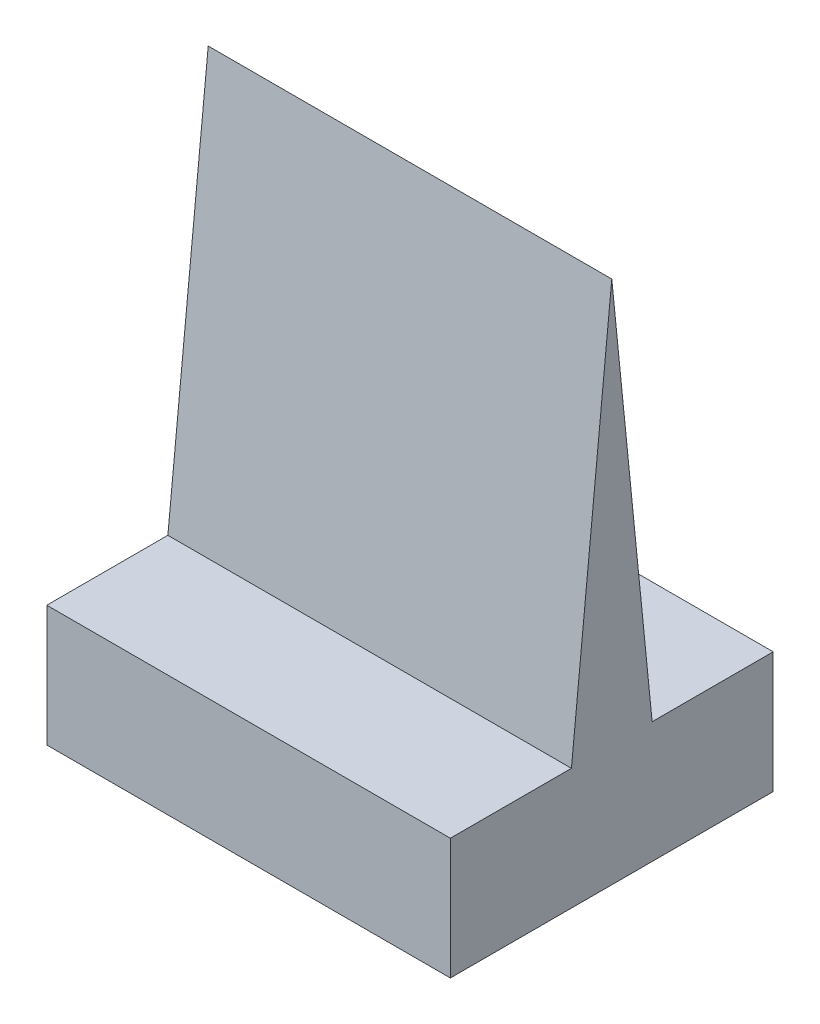
ISO-10303-21;
HEADER;
FILE_DESCRIPTION(('STEP AP214'),'2;1');
FILE_NAME('part.step','',(''),(''),'','','');
FILE_SCHEMA(('AUTOMOTIVE_DESIGN { 1 0 10303 214 1 1 1 1 }'));
ENDSEC;
DATA;
#1=APPLICATION_CONTEXT('core data for automotive mechanical design processes');
#2=APPLICATION_PROTOCOL_DEFINITION('international standard','automotive_design',2000,#1);
#3=PRODUCT_CONTEXT('',#1,'mechanical');
#4=PRODUCT('Part','Part','',(#3));
#5=PRODUCT_RELATED_PRODUCT_CATEGORY('part','',(#4));
#6=PRODUCT_DEFINITION_FORMATION('','',#4);
#7=PRODUCT_DEFINITION_CONTEXT('part definition',#1,'design');
#8=PRODUCT_DEFINITION('design','',#6,#7);
#9=PRODUCT_DEFINITION_SHAPE('','',#8);
#10=(LENGTH_UNIT() NAMED_UNIT(*) SI_UNIT(.MILLI.,.METRE.));
#11=(NAMED_UNIT(*) PLANE_ANGLE_UNIT() SI_UNIT($,.RADIAN.));
#12=(NAMED_UNIT(*) SI_UNIT($,.STERADIAN.) SOLID_ANGLE_UNIT());
#13=UNCERTAINTY_MEASURE_WITH_UNIT(LENGTH_MEASURE(1.E-05),#10,'distance_accuracy_value','');
#14=(GEOMETRIC_REPRESENTATION_CONTEXT(3) GLOBAL_UNCERTAINTY_ASSIGNED_CONTEXT((#13)) GLOBAL_UNIT_ASSIGNED_CONTEXT((#10,
#11,#12)) REPRESENTATION_CONTEXT('',''));
#15=CARTESIAN_POINT('',(0.,0.,0.));
#16=DIRECTION('',(0.,0.,1.));
#17=DIRECTION('',(1.,0.,0.));
#18=AXIS2_PLACEMENT_3D('',#15,#16,#17);
#19=CARTESIAN_POINT('',(12.7,16.51,0.));
#20=DIRECTION('',(0.,-0.0995037190209989,-0.995037190209989));
#21=DIRECTION('',(0.,0.995037190209989,-0.0995037190209989));
#22=AXIS2_PLACEMENT_3D('',#19,#20,#21);
#23=PLANE('',#22);
#24=DIRECTION('',(0.,-0.995037190209989,0.0995037190209989));
#25=VECTOR('',#24,1.);
#26=CARTESIAN_POINT('',(0.,16.51,0.));
#27=LINE('',#26,#25);
#28=CARTESIAN_POINT('',(0.,16.51,0.));
#29=VERTEX_POINT('',#28);
#30=CARTESIAN_POINT('',(0.,3.81,1.27));
#31=VERTEX_POINT('',#30);
#32=EDGE_CURVE('E123',#29,#31,#27,.T.);
#33=ORIENTED_EDGE('',*,*,#32,.T.);
#34=DIRECTION('',(-1.,0.,0.));
#35=VECTOR('',#34,1.);
#36=CARTESIAN_POINT('',(12.7,3.81,1.27));
#37=LINE('',#36,#35);
#38=CARTESIAN_POINT('',(12.7,3.81,1.27));
#39=VERTEX_POINT('',#38);
#40=EDGE_CURVE('E11',#39,#31,#37,.T.);
#41=ORIENTED_EDGE('',*,*,#40,.F.);
#42=DIRECTION('',(0.,-0.995037190209989,0.0995037190209989));
#43=VECTOR('',#42,1.);
#44=CARTESIAN_POINT('',(12.7,16.51,0.));
#45=LINE('',#44,#43);
#46=CARTESIAN_POINT('',(12.7,16.51,0.));
#47=VERTEX_POINT('',#46);
#48=EDGE_CURVE('E136',#47,#39,#45,.T.);
#49=ORIENTED_EDGE('',*,*,#48,.F.);
#50=DIRECTION('',(-1.,0.,0.));
#51=VECTOR('',#50,1.);
#52=CARTESIAN_POINT('',(12.7,16.51,0.));
#53=LINE('',#52,#51);
#54=EDGE_CURVE('E119',#47,#29,#53,.T.);
#55=ORIENTED_EDGE('',*,*,#54,.T.);
#56=EDGE_LOOP('',(#33,#41,#49,#55));
#57=FACE_BOUND('',#56,.T.);
#58=ADVANCED_FACE('F33',(#57),#23,.F.);
#59=CARTESIAN_POINT('',(12.7,3.81,1.27));
#60=DIRECTION('',(0.,-1.,0.));
#61=DIRECTION('',(0.,0.,-1.));
#62=AXIS2_PLACEMENT_3D('',#59,#60,#61);
#63=PLANE('',#62);
#64=DIRECTION('',(0.,0.,1.));
#65=VECTOR('',#64,1.);
#66=CARTESIAN_POINT('',(0.,3.81,1.27));
#67=LINE('',#66,#65);
#68=CARTESIAN_POINT('',(0.,3.81,5.08));
#69=VERTEX_POINT('',#68);
#70=EDGE_CURVE('E126',#31,#69,#67,.T.);
#71=ORIENTED_EDGE('',*,*,#70,.T.);
#72=DIRECTION('',(-1.,0.,0.));
#73=VECTOR('',#72,1.);
#74=CARTESIAN_POINT('',(12.7,3.81,5.08));
#75=LINE('',#74,#73);
#76=CARTESIAN_POINT('',(12.7,3.81,5.08));
#77=VERTEX_POINT('',#76);
#78=EDGE_CURVE('E41',#77,#69,#75,.T.);
#79=ORIENTED_EDGE('',*,*,#78,.F.);
#80=DIRECTION('',(0.,0.,1.));
#81=VECTOR('',#80,1.);
#82=CARTESIAN_POINT('',(12.7,3.81,1.27));
#83=LINE('',#82,#81);
#84=EDGE_CURVE('E89',#39,#77,#83,.T.);
#85=ORIENTED_EDGE('',*,*,#84,.F.);
#86=ORIENTED_EDGE('',*,*,#40,.T.);
#87=EDGE_LOOP('',(#71,#79,#85,#86));
#88=FACE_BOUND('',#87,.T.);
#89=ADVANCED_FACE('F180',(#88),#63,.F.);
#90=CARTESIAN_POINT('',(12.7,3.81,5.08));
#91=DIRECTION('',(0.,0.,-1.));
#92=DIRECTION('',(0.,1.,0.));
#93=AXIS2_PLACEMENT_3D('',#90,#91,#92);
#94=PLANE('',#93);
#95=DIRECTION('',(0.,-1.,0.));
#96=VECTOR('',#95,1.);
#97=CARTESIAN_POINT('',(0.,3.81,5.08));
#98=LINE('',#97,#96);
#99=CARTESIAN_POINT('',(0.,0.,5.08));
#100=VERTEX_POINT('',#99);
#101=EDGE_CURVE('E129',#69,#100,#98,.T.);
#102=ORIENTED_EDGE('',*,*,#101,.T.);
#103=DIRECTION('',(-1.,0.,0.));
#104=VECTOR('',#103,1.);
#105=CARTESIAN_POINT('',(12.7,0.,5.08));
#106=LINE('',#105,#104);
#107=CARTESIAN_POINT('',(12.7,0.,5.08));
#108=VERTEX_POINT('',#107);
#109=EDGE_CURVE('E140',#108,#100,#106,.T.);
#110=ORIENTED_EDGE('',*,*,#109,.F.);
#111=DIRECTION('',(0.,-1.,0.));
#112=VECTOR('',#111,1.);
#113=CARTESIAN_POINT('',(12.7,3.81,5.08));
#114=LINE('',#113,#112);
#115=EDGE_CURVE('E148',#77,#108,#114,.T.);
#116=ORIENTED_EDGE('',*,*,#115,.F.);
#117=ORIENTED_EDGE('',*,*,#78,.T.);
#118=EDGE_LOOP('',(#102,#110,#116,#117));
#119=FACE_BOUND('',#118,.T.);
#120=ADVANCED_FACE('F146',(#119),#94,.F.);
#121=CARTESIAN_POINT('',(12.7,0.,-5.08));
#122=DIRECTION('',(0.,1.,0.));
#123=DIRECTION('',(0.,0.,1.));
#124=AXIS2_PLACEMENT_3D('',#121,#122,#123);
#125=PLANE('',#124);
#126=CARTESIAN_POINT('',(6.35,0.,0.));
#127=DIRECTION('',(0.,-1.,0.));
#128=DIRECTION('',(0.,0.,-1.));
#129=AXIS2_PLACEMENT_3D('',#126,#127,#128);
#130=CIRCLE('',#129,2.54);
#131=CARTESIAN_POINT('',(6.35,0.,-2.54));
#132=VERTEX_POINT('',#131);
#133=EDGE_CURVE('E159',#132,#132,#130,.T.);
#134=ORIENTED_EDGE('',*,*,#133,.F.);
#135=EDGE_LOOP('',(#134));
#136=FACE_BOUND('',#135,.T.);
#137=DIRECTION('',(0.,0.,-1.));
#138=VECTOR('',#137,1.);
#139=CARTESIAN_POINT('',(0.,0.,-5.08));
#140=LINE('',#139,#138);
#141=CARTESIAN_POINT('',(0.,0.,-5.08));
#142=VERTEX_POINT('',#141);
#143=EDGE_CURVE('E131',#100,#142,#140,.T.);
#144=ORIENTED_EDGE('',*,*,#143,.T.);
#145=DIRECTION('',(-1.,0.,0.));
#146=VECTOR('',#145,1.);
#147=CARTESIAN_POINT('',(12.7,0.,-5.08));
#148=LINE('',#147,#146);
#149=CARTESIAN_POINT('',(12.7,0.,-5.08));
#150=VERTEX_POINT('',#149);
#151=EDGE_CURVE('E114',#150,#142,#148,.T.);
#152=ORIENTED_EDGE('',*,*,#151,.F.);
#153=DIRECTION('',(0.,0.,-1.));
#154=VECTOR('',#153,1.);
#155=CARTESIAN_POINT('',(12.7,0.,-5.08));
#156=LINE('',#155,#154);
#157=EDGE_CURVE('E105',#108,#150,#156,.T.);
#158=ORIENTED_EDGE('',*,*,#157,.F.);
#159=ORIENTED_EDGE('',*,*,#109,.T.);
#160=EDGE_LOOP('',(#144,#152,#158,#159));
#161=FACE_BOUND('',#160,.T.);
#162=ADVANCED_FACE('F154',(#136,#161),#125,.F.);
#163=CARTESIAN_POINT('',(12.7,3.81,-5.08));
#164=DIRECTION('',(0.,0.,1.));
#165=DIRECTION('',(0.,-1.,0.));
#166=AXIS2_PLACEMENT_3D('',#163,#164,#165);
#167=PLANE('',#166);
#168=DIRECTION('',(0.,1.,0.));
#169=VECTOR('',#168,1.);
#170=CARTESIAN_POINT('',(0.,3.81,-5.08));
#171=LINE('',#170,#169);
#172=CARTESIAN_POINT('',(0.,3.81,-5.08));
#173=VERTEX_POINT('',#172);
#174=EDGE_CURVE('E113',#142,#173,#171,.T.);
#175=ORIENTED_EDGE('',*,*,#174,.T.);
#176=DIRECTION('',(-1.,0.,0.));
#177=VECTOR('',#176,1.);
#178=CARTESIAN_POINT('',(12.7,3.81,-5.08));
#179=LINE('',#178,#177);
#180=CARTESIAN_POINT('',(12.7,3.81,-5.08));
#181=VERTEX_POINT('',#180);
#182=EDGE_CURVE('E110',#181,#173,#179,.T.);
#183=ORIENTED_EDGE('',*,*,#182,.F.);
#184=DIRECTION('',(0.,1.,0.));
#185=VECTOR('',#184,1.);
#186=CARTESIAN_POINT('',(12.7,3.81,-5.08));
#187=LINE('',#186,#185);
#188=EDGE_CURVE('E99',#150,#181,#187,.T.);
#189=ORIENTED_EDGE('',*,*,#188,.F.);
#190=ORIENTED_EDGE('',*,*,#151,.T.);
#191=EDGE_LOOP('',(#175,#183,#189,#190));
#192=FACE_BOUND('',#191,.T.);
#193=ADVANCED_FACE('F111',(#192),#167,.F.);
#194=CARTESIAN_POINT('',(12.7,3.81,-1.27));
#195=DIRECTION('',(0.,-1.,0.));
#196=DIRECTION('',(0.,0.,-1.));
#197=AXIS2_PLACEMENT_3D('',#194,#195,#196);
#198=PLANE('',#197);
#199=DIRECTION('',(0.,0.,1.));
#200=VECTOR('',#199,1.);
#201=CARTESIAN_POINT('',(0.,3.81,-1.27));
#202=LINE('',#201,#200);
#203=CARTESIAN_POINT('',(0.,3.81,-1.27));
#204=VERTEX_POINT('',#203);
#205=EDGE_CURVE('E75',#173,#204,#202,.T.);
#206=ORIENTED_EDGE('',*,*,#205,.T.);
#207=DIRECTION('',(-1.,0.,0.));
#208=VECTOR('',#207,1.);
#209=CARTESIAN_POINT('',(12.7,3.81,-1.27));
#210=LINE('',#209,#208);
#211=CARTESIAN_POINT('',(12.7,3.81,-1.27));
#212=VERTEX_POINT('',#211);
#213=EDGE_CURVE('E115',#212,#204,#210,.T.);
#214=ORIENTED_EDGE('',*,*,#213,.F.);
#215=DIRECTION('',(0.,0.,1.));
#216=VECTOR('',#215,1.);
#217=CARTESIAN_POINT('',(12.7,3.81,-1.27));
#218=LINE('',#217,#216);
#219=EDGE_CURVE('E103',#181,#212,#218,.T.);
#220=ORIENTED_EDGE('',*,*,#219,.F.);
#221=ORIENTED_EDGE('',*,*,#182,.T.);
#222=EDGE_LOOP('',(#206,#214,#220,#221));
#223=FACE_BOUND('',#222,.T.);
#224=ADVANCED_FACE('F117',(#223),#198,.F.);
#225=CARTESIAN_POINT('',(12.7,3.81,-1.27));
#226=DIRECTION('',(0.,-0.0995037190209989,0.995037190209989));
#227=DIRECTION('',(0.,-0.995037190209989,-0.0995037190209989));
#228=AXIS2_PLACEMENT_3D('',#225,#226,#227);
#229=PLANE('',#228);
#230=DIRECTION('',(0.,0.995037190209989,0.0995037190209989));
#231=VECTOR('',#230,1.);
#232=CARTESIAN_POINT('',(0.,3.81,-1.27));
#233=LINE('',#232,#231);
#234=EDGE_CURVE('E81',#204,#29,#233,.T.);
#235=ORIENTED_EDGE('',*,*,#234,.T.);
#236=ORIENTED_EDGE('',*,*,#54,.F.);
#237=DIRECTION('',(0.,0.995037190209989,0.0995037190209989));
#238=VECTOR('',#237,1.);
#239=CARTESIAN_POINT('',(12.7,3.81,-1.27));
#240=LINE('',#239,#238);
#241=EDGE_CURVE('E49',#212,#47,#240,.T.);
#242=ORIENTED_EDGE('',*,*,#241,.F.);
#243=ORIENTED_EDGE('',*,*,#213,.T.);
#244=EDGE_LOOP('',(#235,#236,#242,#243));
#245=FACE_BOUND('',#244,.T.);
#246=ADVANCED_FACE('F189',(#245),#229,.F.);
#247=CARTESIAN_POINT('',(12.7,3.81,1.27));
#248=DIRECTION('',(-1.,0.,0.));
#249=DIRECTION('',(0.,0.,1.));
#250=AXIS2_PLACEMENT_3D('',#247,#248,#249);
#251=PLANE('',#250);
#252=ORIENTED_EDGE('',*,*,#48,.T.);
#253=ORIENTED_EDGE('',*,*,#84,.T.);
#254=ORIENTED_EDGE('',*,*,#115,.T.);
#255=ORIENTED_EDGE('',*,*,#157,.T.);
#256=ORIENTED_EDGE('',*,*,#188,.T.);
#257=ORIENTED_EDGE('',*,*,#219,.T.);
#258=ORIENTED_EDGE('',*,*,#241,.T.);
#259=EDGE_LOOP('',(#252,#253,#254,#255,#256,#257,#258));
#260=FACE_BOUND('',#259,.T.);
#261=ADVANCED_FACE('F101',(#260),#251,.F.);
#262=CARTESIAN_POINT('',(0.,3.81,1.27));
#263=DIRECTION('',(-1.,0.,0.));
#264=DIRECTION('',(0.,0.,1.));
#265=AXIS2_PLACEMENT_3D('',#262,#263,#264);
#266=PLANE('',#265);
#267=ORIENTED_EDGE('',*,*,#32,.F.);
#268=ORIENTED_EDGE('',*,*,#234,.F.);
#269=ORIENTED_EDGE('',*,*,#205,.F.);
#270=ORIENTED_EDGE('',*,*,#174,.F.);
#271=ORIENTED_EDGE('',*,*,#143,.F.);
#272=ORIENTED_EDGE('',*,*,#101,.F.);
#273=ORIENTED_EDGE('',*,*,#70,.F.);
#274=EDGE_LOOP('',(#267,#268,#269,#270,#271,#272,#273));
#275=FACE_BOUND('',#274,.T.);
#276=ADVANCED_FACE('F152',(#275),#266,.T.);
#277=CARTESIAN_POINT('',(6.35,3.175,0.));
#278=DIRECTION('',(0.,-1.,0.));
#279=DIRECTION('',(0.,0.,-1.));
#280=AXIS2_PLACEMENT_3D('',#277,#278,#279);
#281=CYLINDRICAL_SURFACE('',#280,2.54);
#282=CARTESIAN_POINT('',(6.35,3.175,0.));
#283=DIRECTION('',(0.,-1.,0.));
#284=DIRECTION('',(0.,0.,-1.));
#285=AXIS2_PLACEMENT_3D('',#282,#283,#284);
#286=CIRCLE('',#285,2.54);
#287=CARTESIAN_POINT('',(6.35,3.175,-2.54));
#288=VERTEX_POINT('',#287);
#289=EDGE_CURVE('E127',#288,#288,#286,.T.);
#290=ORIENTED_EDGE('',*,*,#289,.F.);
#291=EDGE_LOOP('',(#290));
#292=FACE_BOUND('',#291,.T.);
#293=ORIENTED_EDGE('',*,*,#133,.T.);
#294=EDGE_LOOP('',(#293));
#295=FACE_BOUND('',#294,.T.);
#296=ADVANCED_FACE('F167',(#292,#295),#281,.F.);
#297=CARTESIAN_POINT('',(6.35,3.175,0.));
#298=DIRECTION('',(0.,-1.,0.));
#299=DIRECTION('',(0.,0.,-1.));
#300=AXIS2_PLACEMENT_3D('',#297,#298,#299);
#301=PLANE('',#300);
#302=ORIENTED_EDGE('',*,*,#289,.T.);
#303=EDGE_LOOP('',(#302));
#304=FACE_BOUND('',#303,.T.);
#305=ADVANCED_FACE('F165',(#304),#301,.T.);
#306=CLOSED_SHELL('',(#58,#89,#120,#162,#193,#224,#246,#261,#276,#296,#305));
#307=MANIFOLD_SOLID_BREP('B2',#306);
#308=ADVANCED_BREP_SHAPE_REPRESENTATION('',(#18,#307),#14);
#309=SHAPE_DEFINITION_REPRESENTATION(#9,#308);
ENDSEC;
END-ISO-10303-21;
